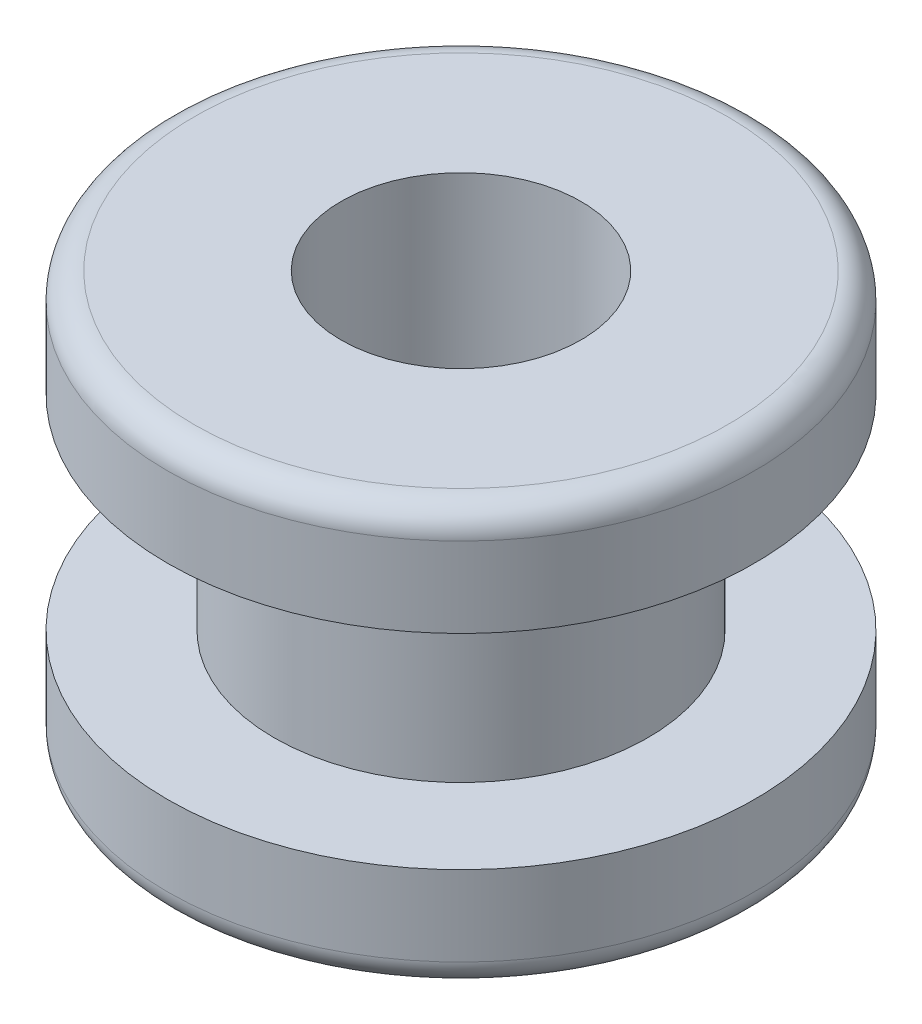
ISO-10303-21;
HEADER;
FILE_DESCRIPTION(('STEP AP214'),'2;1');
FILE_NAME('part.step','',(''),(''),'','','');
FILE_SCHEMA(('AUTOMOTIVE_DESIGN { 1 0 10303 214 1 1 1 1 }'));
ENDSEC;
DATA;
#1=APPLICATION_CONTEXT('core data for automotive mechanical design processes');
#2=APPLICATION_PROTOCOL_DEFINITION('international standard','automotive_design',2000,#1);
#3=PRODUCT_CONTEXT('',#1,'mechanical');
#4=PRODUCT('Part','Part','',(#3));
#5=PRODUCT_RELATED_PRODUCT_CATEGORY('part','',(#4));
#6=PRODUCT_DEFINITION_FORMATION('','',#4);
#7=PRODUCT_DEFINITION_CONTEXT('part definition',#1,'design');
#8=PRODUCT_DEFINITION('design','',#6,#7);
#9=PRODUCT_DEFINITION_SHAPE('','',#8);
#10=(LENGTH_UNIT() NAMED_UNIT(*) SI_UNIT(.MILLI.,.METRE.));
#11=(NAMED_UNIT(*) PLANE_ANGLE_UNIT() SI_UNIT($,.RADIAN.));
#12=(NAMED_UNIT(*) SI_UNIT($,.STERADIAN.) SOLID_ANGLE_UNIT());
#13=UNCERTAINTY_MEASURE_WITH_UNIT(LENGTH_MEASURE(1.E-05),#10,'distance_accuracy_value','');
#14=(GEOMETRIC_REPRESENTATION_CONTEXT(3) GLOBAL_UNCERTAINTY_ASSIGNED_CONTEXT((#13)) GLOBAL_UNIT_ASSIGNED_CONTEXT((#10,
#11,#12)) REPRESENTATION_CONTEXT('',''));
#15=CARTESIAN_POINT('',(0.,0.,0.));
#16=DIRECTION('',(0.,0.,1.));
#17=DIRECTION('',(1.,0.,0.));
#18=AXIS2_PLACEMENT_3D('',#15,#16,#17);
#19=CARTESIAN_POINT('',(0.,-2.35,0.));
#20=DIRECTION('',(0.,-1.,0.));
#21=DIRECTION('',(0.,0.,-1.));
#22=AXIS2_PLACEMENT_3D('',#19,#20,#21);
#23=PLANE('',#22);
#24=CARTESIAN_POINT('',(0.,-2.35,0.));
#25=DIRECTION('',(0.,1.,0.));
#26=DIRECTION('',(0.,0.,1.));
#27=AXIS2_PLACEMENT_3D('',#24,#25,#26);
#28=CIRCLE('',#27,1.35);
#29=CARTESIAN_POINT('',(0.,-2.35,1.35));
#30=VERTEX_POINT('',#29);
#31=EDGE_CURVE('E46',#30,#30,#28,.T.);
#32=ORIENTED_EDGE('',*,*,#31,.T.);
#33=EDGE_LOOP('',(#32));
#34=FACE_BOUND('',#33,.T.);
#35=CARTESIAN_POINT('',(0.,-2.35,0.));
#36=DIRECTION('',(0.,-1.,0.));
#37=DIRECTION('',(0.,0.,-1.));
#38=AXIS2_PLACEMENT_3D('',#35,#36,#37);
#39=CIRCLE('',#38,3.);
#40=CARTESIAN_POINT('',(0.,-2.35,-3.));
#41=VERTEX_POINT('',#40);
#42=EDGE_CURVE('E25',#41,#41,#39,.T.);
#43=ORIENTED_EDGE('',*,*,#42,.T.);
#44=EDGE_LOOP('',(#43));
#45=FACE_BOUND('',#44,.T.);
#46=ADVANCED_FACE('F14',(#34,#45),#23,.T.);
#47=CARTESIAN_POINT('',(0.,2.35,0.));
#48=DIRECTION('',(0.,1.,0.));
#49=DIRECTION('',(0.,0.,1.));
#50=AXIS2_PLACEMENT_3D('',#47,#48,#49);
#51=CYLINDRICAL_SURFACE('',#50,3.3);
#52=CARTESIAN_POINT('',(0.,-2.05,0.));
#53=DIRECTION('',(0.,-1.,0.));
#54=DIRECTION('',(0.,0.,-1.));
#55=AXIS2_PLACEMENT_3D('',#52,#53,#54);
#56=CIRCLE('',#55,3.3);
#57=CARTESIAN_POINT('',(0.,-2.05,-3.3));
#58=VERTEX_POINT('',#57);
#59=EDGE_CURVE('E29',#58,#58,#56,.F.);
#60=ORIENTED_EDGE('',*,*,#59,.T.);
#61=EDGE_LOOP('',(#60));
#62=FACE_BOUND('',#61,.T.);
#63=CARTESIAN_POINT('',(0.,-1.15,0.));
#64=DIRECTION('',(0.,1.,0.));
#65=DIRECTION('',(0.,0.,1.));
#66=AXIS2_PLACEMENT_3D('',#63,#64,#65);
#67=CIRCLE('',#66,3.3);
#68=CARTESIAN_POINT('',(0.,-1.15,3.3));
#69=VERTEX_POINT('',#68);
#70=EDGE_CURVE('E34',#69,#69,#67,.T.);
#71=ORIENTED_EDGE('',*,*,#70,.F.);
#72=EDGE_LOOP('',(#71));
#73=FACE_BOUND('',#72,.T.);
#74=ADVANCED_FACE('F76',(#62,#73),#51,.T.);
#75=CARTESIAN_POINT('',(-3.3,-1.15,0.));
#76=DIRECTION('',(0.,1.,0.));
#77=DIRECTION('',(0.,0.,1.));
#78=AXIS2_PLACEMENT_3D('',#75,#76,#77);
#79=PLANE('',#78);
#80=ORIENTED_EDGE('',*,*,#70,.T.);
#81=EDGE_LOOP('',(#80));
#82=FACE_BOUND('',#81,.T.);
#83=CARTESIAN_POINT('',(0.,-1.15,0.));
#84=DIRECTION('',(0.,1.,0.));
#85=DIRECTION('',(0.,0.,1.));
#86=AXIS2_PLACEMENT_3D('',#83,#84,#85);
#87=CIRCLE('',#86,2.1);
#88=CARTESIAN_POINT('',(0.,-1.15,2.1));
#89=VERTEX_POINT('',#88);
#90=EDGE_CURVE('E37',#89,#89,#87,.T.);
#91=ORIENTED_EDGE('',*,*,#90,.F.);
#92=EDGE_LOOP('',(#91));
#93=FACE_BOUND('',#92,.T.);
#94=ADVANCED_FACE('F82',(#82,#93),#79,.T.);
#95=CARTESIAN_POINT('',(0.,2.35,0.));
#96=DIRECTION('',(0.,1.,0.));
#97=DIRECTION('',(0.,0.,1.));
#98=AXIS2_PLACEMENT_3D('',#95,#96,#97);
#99=CYLINDRICAL_SURFACE('',#98,2.1);
#100=ORIENTED_EDGE('',*,*,#90,.T.);
#101=EDGE_LOOP('',(#100));
#102=FACE_BOUND('',#101,.T.);
#103=CARTESIAN_POINT('',(0.,1.15,0.));
#104=DIRECTION('',(0.,1.,0.));
#105=DIRECTION('',(0.,0.,1.));
#106=AXIS2_PLACEMENT_3D('',#103,#104,#105);
#107=CIRCLE('',#106,2.1);
#108=CARTESIAN_POINT('',(0.,1.15,2.1));
#109=VERTEX_POINT('',#108);
#110=EDGE_CURVE('E40',#109,#109,#107,.T.);
#111=ORIENTED_EDGE('',*,*,#110,.F.);
#112=EDGE_LOOP('',(#111));
#113=FACE_BOUND('',#112,.T.);
#114=ADVANCED_FACE('F88',(#102,#113),#99,.T.);
#115=CARTESIAN_POINT('',(-3.3,1.15,0.));
#116=DIRECTION('',(0.,-1.,0.));
#117=DIRECTION('',(0.,0.,-1.));
#118=AXIS2_PLACEMENT_3D('',#115,#116,#117);
#119=PLANE('',#118);
#120=ORIENTED_EDGE('',*,*,#110,.T.);
#121=EDGE_LOOP('',(#120));
#122=FACE_BOUND('',#121,.T.);
#123=CARTESIAN_POINT('',(0.,1.15,0.));
#124=DIRECTION('',(0.,1.,0.));
#125=DIRECTION('',(0.,0.,1.));
#126=AXIS2_PLACEMENT_3D('',#123,#124,#125);
#127=CIRCLE('',#126,3.3);
#128=CARTESIAN_POINT('',(0.,1.15,3.3));
#129=VERTEX_POINT('',#128);
#130=EDGE_CURVE('E43',#129,#129,#127,.T.);
#131=ORIENTED_EDGE('',*,*,#130,.F.);
#132=EDGE_LOOP('',(#131));
#133=FACE_BOUND('',#132,.T.);
#134=ADVANCED_FACE('F73',(#122,#133),#119,.T.);
#135=CARTESIAN_POINT('',(0.,2.35,0.));
#136=DIRECTION('',(0.,1.,0.));
#137=DIRECTION('',(0.,0.,1.));
#138=AXIS2_PLACEMENT_3D('',#135,#136,#137);
#139=CYLINDRICAL_SURFACE('',#138,3.3);
#140=CARTESIAN_POINT('',(0.,2.05,0.));
#141=DIRECTION('',(0.,1.,0.));
#142=DIRECTION('',(0.,0.,1.));
#143=AXIS2_PLACEMENT_3D('',#140,#141,#142);
#144=CIRCLE('',#143,3.3);
#145=CARTESIAN_POINT('',(0.,2.05,3.3));
#146=VERTEX_POINT('',#145);
#147=EDGE_CURVE('E10',#146,#146,#144,.F.);
#148=ORIENTED_EDGE('',*,*,#147,.T.);
#149=EDGE_LOOP('',(#148));
#150=FACE_BOUND('',#149,.T.);
#151=ORIENTED_EDGE('',*,*,#130,.T.);
#152=EDGE_LOOP('',(#151));
#153=FACE_BOUND('',#152,.T.);
#154=ADVANCED_FACE('F64',(#150,#153),#139,.T.);
#155=CARTESIAN_POINT('',(0.,2.35,0.));
#156=DIRECTION('',(0.,1.,0.));
#157=DIRECTION('',(0.,0.,1.));
#158=AXIS2_PLACEMENT_3D('',#155,#156,#157);
#159=PLANE('',#158);
#160=CARTESIAN_POINT('',(0.,2.35,0.));
#161=DIRECTION('',(0.,1.,0.));
#162=DIRECTION('',(0.,0.,1.));
#163=AXIS2_PLACEMENT_3D('',#160,#161,#162);
#164=CIRCLE('',#163,1.35);
#165=CARTESIAN_POINT('',(0.,2.35,1.35));
#166=VERTEX_POINT('',#165);
#167=EDGE_CURVE('E47',#166,#166,#164,.T.);
#168=ORIENTED_EDGE('',*,*,#167,.F.);
#169=EDGE_LOOP('',(#168));
#170=FACE_BOUND('',#169,.T.);
#171=CARTESIAN_POINT('',(0.,2.35,0.));
#172=DIRECTION('',(0.,1.,0.));
#173=DIRECTION('',(0.,0.,1.));
#174=AXIS2_PLACEMENT_3D('',#171,#172,#173);
#175=CIRCLE('',#174,3.);
#176=CARTESIAN_POINT('',(0.,2.35,3.));
#177=VERTEX_POINT('',#176);
#178=EDGE_CURVE('E21',#177,#177,#175,.T.);
#179=ORIENTED_EDGE('',*,*,#178,.T.);
#180=EDGE_LOOP('',(#179));
#181=FACE_BOUND('',#180,.T.);
#182=ADVANCED_FACE('F61',(#170,#181),#159,.T.);
#183=CARTESIAN_POINT('',(0.,-2.05,0.));
#184=DIRECTION('',(0.,-1.,0.));
#185=DIRECTION('',(0.,0.,-1.));
#186=AXIS2_PLACEMENT_3D('',#183,#184,#185);
#187=TOROIDAL_SURFACE('',#186,3.,0.3);
#188=ORIENTED_EDGE('',*,*,#42,.F.);
#189=EDGE_LOOP('',(#188));
#190=FACE_BOUND('',#189,.T.);
#191=ORIENTED_EDGE('',*,*,#59,.F.);
#192=EDGE_LOOP('',(#191));
#193=FACE_BOUND('',#192,.T.);
#194=ADVANCED_FACE('F63',(#190,#193),#187,.T.);
#195=CARTESIAN_POINT('',(0.,2.05,0.));
#196=DIRECTION('',(0.,1.,0.));
#197=DIRECTION('',(0.,0.,1.));
#198=AXIS2_PLACEMENT_3D('',#195,#196,#197);
#199=TOROIDAL_SURFACE('',#198,3.,0.3);
#200=ORIENTED_EDGE('',*,*,#147,.F.);
#201=EDGE_LOOP('',(#200));
#202=FACE_BOUND('',#201,.T.);
#203=ORIENTED_EDGE('',*,*,#178,.F.);
#204=EDGE_LOOP('',(#203));
#205=FACE_BOUND('',#204,.T.);
#206=ADVANCED_FACE('F16',(#202,#205),#199,.T.);
#207=CARTESIAN_POINT('',(0.,-2.35,0.));
#208=DIRECTION('',(0.,1.,0.));
#209=DIRECTION('',(0.,0.,1.));
#210=AXIS2_PLACEMENT_3D('',#207,#208,#209);
#211=CYLINDRICAL_SURFACE('',#210,1.35);
#212=ORIENTED_EDGE('',*,*,#31,.F.);
#213=EDGE_LOOP('',(#212));
#214=FACE_BOUND('',#213,.T.);
#215=ORIENTED_EDGE('',*,*,#167,.T.);
#216=EDGE_LOOP('',(#215));
#217=FACE_BOUND('',#216,.T.);
#218=ADVANCED_FACE('F55',(#214,#217),#211,.F.);
#219=CLOSED_SHELL('',(#46,#74,#94,#114,#134,#154,#182,#194,#206,#218));
#220=MANIFOLD_SOLID_BREP('B1',#219);
#221=ADVANCED_BREP_SHAPE_REPRESENTATION('',(#18,#220),#14);
#222=SHAPE_DEFINITION_REPRESENTATION(#9,#221);
ENDSEC;
END-ISO-10303-21;
